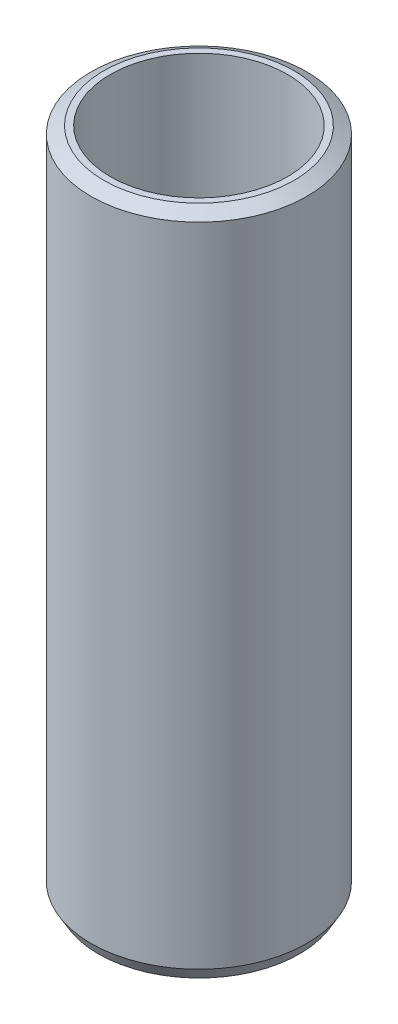
ISO-10303-21;
HEADER;
FILE_DESCRIPTION(('STEP AP214'),'2;1');
FILE_NAME('part.step','',(''),(''),'','','');
FILE_SCHEMA(('AUTOMOTIVE_DESIGN { 1 0 10303 214 1 1 1 1 }'));
ENDSEC;
DATA;
#1=APPLICATION_CONTEXT('core data for automotive mechanical design processes');
#2=APPLICATION_PROTOCOL_DEFINITION('international standard','automotive_design',2000,#1);
#3=PRODUCT_CONTEXT('',#1,'mechanical');
#4=PRODUCT('Part','Part','',(#3));
#5=PRODUCT_RELATED_PRODUCT_CATEGORY('part','',(#4));
#6=PRODUCT_DEFINITION_FORMATION('','',#4);
#7=PRODUCT_DEFINITION_CONTEXT('part definition',#1,'design');
#8=PRODUCT_DEFINITION('design','',#6,#7);
#9=PRODUCT_DEFINITION_SHAPE('','',#8);
#10=(LENGTH_UNIT() NAMED_UNIT(*) SI_UNIT(.MILLI.,.METRE.));
#11=(NAMED_UNIT(*) PLANE_ANGLE_UNIT() SI_UNIT($,.RADIAN.));
#12=(NAMED_UNIT(*) SI_UNIT($,.STERADIAN.) SOLID_ANGLE_UNIT());
#13=UNCERTAINTY_MEASURE_WITH_UNIT(LENGTH_MEASURE(1.E-05),#10,'distance_accuracy_value','');
#14=(GEOMETRIC_REPRESENTATION_CONTEXT(3) GLOBAL_UNCERTAINTY_ASSIGNED_CONTEXT((#13)) GLOBAL_UNIT_ASSIGNED_CONTEXT((#10,
#11,#12)) REPRESENTATION_CONTEXT('',''));
#15=CARTESIAN_POINT('',(0.,0.,0.));
#16=DIRECTION('',(0.,0.,1.));
#17=DIRECTION('',(1.,0.,0.));
#18=AXIS2_PLACEMENT_3D('',#15,#16,#17);
#19=CARTESIAN_POINT('',(0.,278.2284351092,0.));
#20=DIRECTION('',(0.,-1.,0.));
#21=DIRECTION('',(0.,0.,-1.));
#22=AXIS2_PLACEMENT_3D('',#19,#20,#21);
#23=CYLINDRICAL_SURFACE('',#22,45.);
#24=CARTESIAN_POINT('',(0.,275.141164923945,0.));
#25=DIRECTION('',(0.,1.,0.));
#26=DIRECTION('',(0.,0.,1.));
#27=AXIS2_PLACEMENT_3D('',#24,#25,#26);
#28=CIRCLE('',#27,45.);
#29=CARTESIAN_POINT('',(0.,275.141164923945,45.));
#30=VERTEX_POINT('',#29);
#31=EDGE_CURVE('E50',#30,#30,#28,.F.);
#32=ORIENTED_EDGE('',*,*,#31,.T.);
#33=EDGE_LOOP('',(#32));
#34=FACE_BOUND('',#33,.T.);
#35=CARTESIAN_POINT('',(0.,5.34730881755408,0.));
#36=DIRECTION('',(0.,1.,0.));
#37=DIRECTION('',(0.,0.,1.));
#38=AXIS2_PLACEMENT_3D('',#35,#36,#37);
#39=CIRCLE('',#38,45.);
#40=CARTESIAN_POINT('',(0.,5.34730881755408,45.));
#41=VERTEX_POINT('',#40);
#42=EDGE_CURVE('E51',#41,#41,#39,.T.);
#43=ORIENTED_EDGE('',*,*,#42,.T.);
#44=EDGE_LOOP('',(#43));
#45=FACE_BOUND('',#44,.T.);
#46=ADVANCED_FACE('F39',(#34,#45),#23,.T.);
#47=CARTESIAN_POINT('',(0.,278.2284351092,0.));
#48=DIRECTION('',(0.,1.,0.));
#49=DIRECTION('',(0.,0.,1.));
#50=AXIS2_PLACEMENT_3D('',#47,#48,#49);
#51=PLANE('',#50);
#52=CARTESIAN_POINT('',(0.,278.2284351092,0.));
#53=DIRECTION('',(0.,1.,0.));
#54=DIRECTION('',(0.,0.,1.));
#55=AXIS2_PLACEMENT_3D('',#52,#53,#54);
#56=CIRCLE('',#55,39.6526911824458);
#57=CARTESIAN_POINT('',(0.,278.2284351092,39.6526911824458));
#58=VERTEX_POINT('',#57);
#59=EDGE_CURVE('E54',#58,#58,#56,.T.);
#60=ORIENTED_EDGE('',*,*,#59,.T.);
#61=EDGE_LOOP('',(#60));
#62=FACE_BOUND('',#61,.T.);
#63=CARTESIAN_POINT('',(0.,278.2284351092,0.));
#64=DIRECTION('',(0.,1.,0.));
#65=DIRECTION('',(0.,0.,1.));
#66=AXIS2_PLACEMENT_3D('',#63,#64,#65);
#67=CIRCLE('',#66,36.9569886062635);
#68=CARTESIAN_POINT('',(0.,278.2284351092,36.9569886062635));
#69=VERTEX_POINT('',#68);
#70=EDGE_CURVE('E58',#69,#69,#67,.T.);
#71=ORIENTED_EDGE('',*,*,#70,.F.);
#72=EDGE_LOOP('',(#71));
#73=FACE_BOUND('',#72,.T.);
#74=ADVANCED_FACE('F69',(#62,#73),#51,.T.);
#75=CARTESIAN_POINT('',(0.,0.,0.));
#76=DIRECTION('',(0.,1.,0.));
#77=DIRECTION('',(0.,0.,1.));
#78=AXIS2_PLACEMENT_3D('',#75,#76,#77);
#79=PLANE('',#78);
#80=CARTESIAN_POINT('',(0.,0.,0.));
#81=DIRECTION('',(0.,1.,0.));
#82=DIRECTION('',(0.,0.,1.));
#83=AXIS2_PLACEMENT_3D('',#80,#81,#82);
#84=CIRCLE('',#83,41.912729814745);
#85=CARTESIAN_POINT('',(0.,0.,41.912729814745));
#86=VERTEX_POINT('',#85);
#87=EDGE_CURVE('E10',#86,#86,#84,.F.);
#88=ORIENTED_EDGE('',*,*,#87,.T.);
#89=EDGE_LOOP('',(#88));
#90=FACE_BOUND('',#89,.T.);
#91=CARTESIAN_POINT('',(0.,0.,0.));
#92=DIRECTION('',(0.,1.,0.));
#93=DIRECTION('',(0.,0.,1.));
#94=AXIS2_PLACEMENT_3D('',#91,#92,#93);
#95=CIRCLE('',#94,36.9569886062635);
#96=CARTESIAN_POINT('',(0.,0.,36.9569886062635));
#97=VERTEX_POINT('',#96);
#98=EDGE_CURVE('E63',#97,#97,#95,.T.);
#99=ORIENTED_EDGE('',*,*,#98,.T.);
#100=EDGE_LOOP('',(#99));
#101=FACE_BOUND('',#100,.T.);
#102=ADVANCED_FACE('F75',(#90,#101),#79,.F.);
#103=CARTESIAN_POINT('',(0.,278.2284351092,0.));
#104=DIRECTION('',(0.,-1.,0.));
#105=DIRECTION('',(0.,0.,-1.));
#106=AXIS2_PLACEMENT_3D('',#103,#104,#105);
#107=CYLINDRICAL_SURFACE('',#106,36.9569886062635);
#108=ORIENTED_EDGE('',*,*,#70,.T.);
#109=EDGE_LOOP('',(#108));
#110=FACE_BOUND('',#109,.T.);
#111=ORIENTED_EDGE('',*,*,#98,.F.);
#112=EDGE_LOOP('',(#111));
#113=FACE_BOUND('',#112,.T.);
#114=ADVANCED_FACE('F70',(#110,#113),#107,.F.);
#115=CARTESIAN_POINT('',(0.,278.2284351092,0.));
#116=DIRECTION('',(0.,-1.,0.));
#117=DIRECTION('',(0.,0.,-1.));
#118=AXIS2_PLACEMENT_3D('',#115,#116,#117);
#119=CONICAL_SURFACE('',#118,39.6526911824458,1.04719755119659);
#120=ORIENTED_EDGE('',*,*,#31,.F.);
#121=EDGE_LOOP('',(#120));
#122=FACE_BOUND('',#121,.T.);
#123=ORIENTED_EDGE('',*,*,#59,.F.);
#124=EDGE_LOOP('',(#123));
#125=FACE_BOUND('',#124,.T.);
#126=ADVANCED_FACE('F81',(#122,#125),#119,.T.);
#127=CARTESIAN_POINT('',(0.,5.34730881755408,0.));
#128=DIRECTION('',(0.,1.,0.));
#129=DIRECTION('',(0.,0.,1.));
#130=AXIS2_PLACEMENT_3D('',#127,#128,#129);
#131=CONICAL_SURFACE('',#130,45.,0.523598775598307);
#132=ORIENTED_EDGE('',*,*,#87,.F.);
#133=EDGE_LOOP('',(#132));
#134=FACE_BOUND('',#133,.T.);
#135=ORIENTED_EDGE('',*,*,#42,.F.);
#136=EDGE_LOOP('',(#135));
#137=FACE_BOUND('',#136,.T.);
#138=ADVANCED_FACE('F45',(#134,#137),#131,.T.);
#139=CLOSED_SHELL('',(#46,#74,#102,#114,#126,#138));
#140=MANIFOLD_SOLID_BREP('B2',#139);
#141=ADVANCED_BREP_SHAPE_REPRESENTATION('',(#18,#140),#14);
#142=SHAPE_DEFINITION_REPRESENTATION(#9,#141);
ENDSEC;
END-ISO-10303-21;
